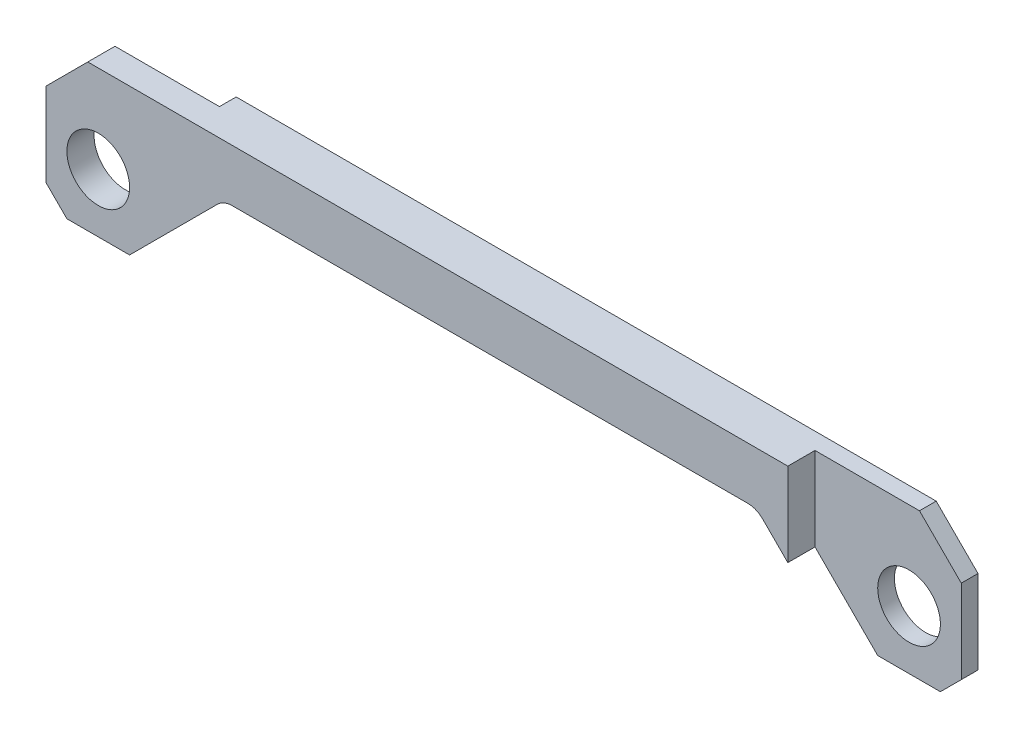
ISO-10303-21;
HEADER;
FILE_DESCRIPTION(('STEP AP214'),'2;1');
FILE_NAME('part.step','',(''),(''),'','','');
FILE_SCHEMA(('AUTOMOTIVE_DESIGN { 1 0 10303 214 1 1 1 1 }'));
ENDSEC;
DATA;
#1=APPLICATION_CONTEXT('core data for automotive mechanical design processes');
#2=APPLICATION_PROTOCOL_DEFINITION('international standard','automotive_design',2000,#1);
#3=PRODUCT_CONTEXT('',#1,'mechanical');
#4=PRODUCT('Part','Part','',(#3));
#5=PRODUCT_RELATED_PRODUCT_CATEGORY('part','',(#4));
#6=PRODUCT_DEFINITION_FORMATION('','',#4);
#7=PRODUCT_DEFINITION_CONTEXT('part definition',#1,'design');
#8=PRODUCT_DEFINITION('design','',#6,#7);
#9=PRODUCT_DEFINITION_SHAPE('','',#8);
#10=(LENGTH_UNIT() NAMED_UNIT(*) SI_UNIT(.MILLI.,.METRE.));
#11=(NAMED_UNIT(*) PLANE_ANGLE_UNIT() SI_UNIT($,.RADIAN.));
#12=(NAMED_UNIT(*) SI_UNIT($,.STERADIAN.) SOLID_ANGLE_UNIT());
#13=UNCERTAINTY_MEASURE_WITH_UNIT(LENGTH_MEASURE(1.E-05),#10,'distance_accuracy_value','');
#14=(GEOMETRIC_REPRESENTATION_CONTEXT(3) GLOBAL_UNCERTAINTY_ASSIGNED_CONTEXT((#13)) GLOBAL_UNIT_ASSIGNED_CONTEXT((#10,
#11,#12)) REPRESENTATION_CONTEXT('',''));
#15=CARTESIAN_POINT('',(0.,0.,0.));
#16=DIRECTION('',(0.,0.,1.));
#17=DIRECTION('',(1.,0.,0.));
#18=AXIS2_PLACEMENT_3D('',#15,#16,#17);
#19=CARTESIAN_POINT('',(0.,0.,53.34));
#20=DIRECTION('',(0.,0.,-1.));
#21=DIRECTION('',(-1.,0.,0.));
#22=AXIS2_PLACEMENT_3D('',#19,#20,#21);
#23=PLANE('',#22);
#24=DIRECTION('',(1.,0.,0.));
#25=VECTOR('',#24,1.);
#26=CARTESIAN_POINT('',(800.100000000001,43.1800000000001,53.34));
#27=LINE('',#26,#25);
#28=CARTESIAN_POINT('',(162.921024484276,43.18,53.34));
#29=VERTEX_POINT('',#28);
#30=CARTESIAN_POINT('',(789.578975515724,43.1800000000001,53.34));
#31=VERTEX_POINT('',#30);
#32=EDGE_CURVE('E272',#29,#31,#27,.T.);
#33=ORIENTED_EDGE('',*,*,#32,.T.);
#34=CARTESIAN_POINT('',(789.578975515724,17.7800000000001,53.34));
#35=DIRECTION('',(0.,0.,-1.));
#36=DIRECTION('',(-1.,0.,0.));
#37=AXIS2_PLACEMENT_3D('',#34,#35,#36);
#38=CIRCLE('',#37,25.4);
#39=CARTESIAN_POINT('',(807.539487757862,35.7405122421383,53.34));
#40=VERTEX_POINT('',#39);
#41=EDGE_CURVE('E11',#31,#40,#38,.T.);
#42=ORIENTED_EDGE('',*,*,#41,.T.);
#43=DIRECTION('',(0.707106781186546,-0.707106781186549,0.));
#44=VECTOR('',#43,1.);
#45=CARTESIAN_POINT('',(914.4,-71.1199999999999,53.34));
#46=LINE('',#45,#44);
#47=CARTESIAN_POINT('',(838.2,5.08000000000058,53.34));
#48=VERTEX_POINT('',#47);
#49=EDGE_CURVE('E275',#40,#48,#46,.T.);
#50=ORIENTED_EDGE('',*,*,#49,.T.);
#51=DIRECTION('',(0.,1.,0.));
#52=VECTOR('',#51,1.);
#53=CARTESIAN_POINT('',(838.2,-71.12,53.34));
#54=LINE('',#53,#52);
#55=CARTESIAN_POINT('',(838.2,106.68,53.34));
#56=VERTEX_POINT('',#55);
#57=EDGE_CURVE('E218',#48,#56,#54,.T.);
#58=ORIENTED_EDGE('',*,*,#57,.T.);
#59=DIRECTION('',(-1.,0.,0.));
#60=VECTOR('',#59,1.);
#61=CARTESIAN_POINT('',(-12.7000000000002,106.68,53.34));
#62=LINE('',#61,#60);
#63=CARTESIAN_POINT('',(-12.7000000000002,106.68,53.34));
#64=VERTEX_POINT('',#63);
#65=EDGE_CURVE('E278',#56,#64,#62,.T.);
#66=ORIENTED_EDGE('',*,*,#65,.T.);
#67=DIRECTION('',(-0.707106781186546,-0.707106781186549,0.));
#68=VECTOR('',#67,1.);
#69=CARTESIAN_POINT('',(-63.4999999999999,55.88,53.34));
#70=LINE('',#69,#68);
#71=CARTESIAN_POINT('',(-63.4999999999999,55.88,53.34));
#72=VERTEX_POINT('',#71);
#73=EDGE_CURVE('E281',#64,#72,#70,.T.);
#74=ORIENTED_EDGE('',*,*,#73,.T.);
#75=DIRECTION('',(0.,-1.,0.));
#76=VECTOR('',#75,1.);
#77=CARTESIAN_POINT('',(-63.4999999999999,-45.7200000000001,53.34));
#78=LINE('',#77,#76);
#79=CARTESIAN_POINT('',(-63.4999999999999,-45.7200000000001,53.34));
#80=VERTEX_POINT('',#79);
#81=EDGE_CURVE('E284',#72,#80,#78,.T.);
#82=ORIENTED_EDGE('',*,*,#81,.T.);
#83=DIRECTION('',(0.707106781186549,-0.707106781186546,0.));
#84=VECTOR('',#83,1.);
#85=CARTESIAN_POINT('',(-38.1,-71.12,53.34));
#86=LINE('',#85,#84);
#87=CARTESIAN_POINT('',(-38.1,-71.12,53.34));
#88=VERTEX_POINT('',#87);
#89=EDGE_CURVE('E287',#80,#88,#86,.T.);
#90=ORIENTED_EDGE('',*,*,#89,.T.);
#91=DIRECTION('',(1.,0.,0.));
#92=VECTOR('',#91,1.);
#93=CARTESIAN_POINT('',(38.1,-71.12,53.34));
#94=LINE('',#93,#92);
#95=CARTESIAN_POINT('',(38.1,-71.12,53.34));
#96=VERTEX_POINT('',#95);
#97=EDGE_CURVE('E290',#88,#96,#94,.T.);
#98=ORIENTED_EDGE('',*,*,#97,.T.);
#99=DIRECTION('',(0.707106781186546,0.707106781186549,0.));
#100=VECTOR('',#99,1.);
#101=CARTESIAN_POINT('',(152.399999999999,43.18,53.34));
#102=LINE('',#101,#100);
#103=CARTESIAN_POINT('',(144.960512242138,35.7405122421383,53.34));
#104=VERTEX_POINT('',#103);
#105=EDGE_CURVE('E268',#96,#104,#102,.T.);
#106=ORIENTED_EDGE('',*,*,#105,.T.);
#107=CARTESIAN_POINT('',(162.921024484276,17.78,53.34));
#108=DIRECTION('',(0.,0.,-1.));
#109=DIRECTION('',(-1.,0.,0.));
#110=AXIS2_PLACEMENT_3D('',#107,#108,#109);
#111=CIRCLE('',#110,25.4);
#112=EDGE_CURVE('E378',#104,#29,#111,.T.);
#113=ORIENTED_EDGE('',*,*,#112,.T.);
#114=EDGE_LOOP('',(#33,#42,#50,#58,#66,#74,#82,#90,#98,#106,#113));
#115=FACE_BOUND('',#114,.T.);
#116=CARTESIAN_POINT('',(0.,0.,53.34));
#117=DIRECTION('',(0.,0.,1.));
#118=DIRECTION('',(1.,0.,0.));
#119=AXIS2_PLACEMENT_3D('',#116,#117,#118);
#120=CIRCLE('',#119,38.1);
#121=CARTESIAN_POINT('',(38.1,0.,53.34));
#122=VERTEX_POINT('',#121);
#123=EDGE_CURVE('E263',#122,#122,#120,.T.);
#124=ORIENTED_EDGE('',*,*,#123,.F.);
#125=EDGE_LOOP('',(#124));
#126=FACE_BOUND('',#125,.T.);
#127=ADVANCED_FACE('F45',(#115,#126),#23,.F.);
#128=CARTESIAN_POINT('',(0.,0.,0.));
#129=DIRECTION('',(0.,0.,-1.));
#130=DIRECTION('',(-1.,0.,0.));
#131=AXIS2_PLACEMENT_3D('',#128,#129,#130);
#132=PLANE('',#131);
#133=DIRECTION('',(0.,1.,0.));
#134=VECTOR('',#133,1.);
#135=CARTESIAN_POINT('',(114.3,-71.12,0.));
#136=LINE('',#135,#134);
#137=CARTESIAN_POINT('',(114.3,5.08000000000033,0.));
#138=VERTEX_POINT('',#137);
#139=CARTESIAN_POINT('',(114.3,106.68,0.));
#140=VERTEX_POINT('',#139);
#141=EDGE_CURVE('E180',#138,#140,#136,.T.);
#142=ORIENTED_EDGE('',*,*,#141,.T.);
#143=DIRECTION('',(-1.,0.,0.));
#144=VECTOR('',#143,1.);
#145=CARTESIAN_POINT('',(-12.7000000000002,106.68,0.));
#146=LINE('',#145,#144);
#147=CARTESIAN_POINT('',(965.2,106.68,0.));
#148=VERTEX_POINT('',#147);
#149=EDGE_CURVE('E197',#148,#140,#146,.T.);
#150=ORIENTED_EDGE('',*,*,#149,.F.);
#151=DIRECTION('',(-0.707106781186548,0.707106781186547,0.));
#152=VECTOR('',#151,1.);
#153=CARTESIAN_POINT('',(965.2,106.68,0.));
#154=LINE('',#153,#152);
#155=CARTESIAN_POINT('',(1016.,55.8800000000002,0.));
#156=VERTEX_POINT('',#155);
#157=EDGE_CURVE('E316',#156,#148,#154,.T.);
#158=ORIENTED_EDGE('',*,*,#157,.F.);
#159=DIRECTION('',(0.,1.,0.));
#160=VECTOR('',#159,1.);
#161=CARTESIAN_POINT('',(1016.,55.8800000000002,0.));
#162=LINE('',#161,#160);
#163=CARTESIAN_POINT('',(1016.,-45.7199999999999,0.));
#164=VERTEX_POINT('',#163);
#165=EDGE_CURVE('E312',#164,#156,#162,.T.);
#166=ORIENTED_EDGE('',*,*,#165,.F.);
#167=DIRECTION('',(0.707106781186545,0.707106781186549,0.));
#168=VECTOR('',#167,1.);
#169=CARTESIAN_POINT('',(1016.,-45.7199999999999,0.));
#170=LINE('',#169,#168);
#171=CARTESIAN_POINT('',(990.6,-71.1199999999999,0.));
#172=VERTEX_POINT('',#171);
#173=EDGE_CURVE('E308',#172,#164,#170,.T.);
#174=ORIENTED_EDGE('',*,*,#173,.F.);
#175=DIRECTION('',(1.,0.,0.));
#176=VECTOR('',#175,1.);
#177=CARTESIAN_POINT('',(990.6,-71.1199999999999,0.));
#178=LINE('',#177,#176);
#179=CARTESIAN_POINT('',(914.4,-71.1199999999999,0.));
#180=VERTEX_POINT('',#179);
#181=EDGE_CURVE('E304',#180,#172,#178,.T.);
#182=ORIENTED_EDGE('',*,*,#181,.F.);
#183=DIRECTION('',(0.707106781186546,-0.707106781186549,0.));
#184=VECTOR('',#183,1.);
#185=CARTESIAN_POINT('',(914.4,-71.1199999999999,0.));
#186=LINE('',#185,#184);
#187=CARTESIAN_POINT('',(807.539487757862,35.7405122421383,0.));
#188=VERTEX_POINT('',#187);
#189=EDGE_CURVE('E301',#188,#180,#186,.T.);
#190=ORIENTED_EDGE('',*,*,#189,.F.);
#191=CARTESIAN_POINT('',(789.578975515724,17.7800000000001,0.));
#192=DIRECTION('',(0.,0.,-1.));
#193=DIRECTION('',(-1.,0.,0.));
#194=AXIS2_PLACEMENT_3D('',#191,#192,#193);
#195=CIRCLE('',#194,25.4);
#196=CARTESIAN_POINT('',(789.578975515724,43.1800000000001,0.));
#197=VERTEX_POINT('',#196);
#198=EDGE_CURVE('E54',#188,#197,#195,.F.);
#199=ORIENTED_EDGE('',*,*,#198,.T.);
#200=DIRECTION('',(1.,0.,0.));
#201=VECTOR('',#200,1.);
#202=CARTESIAN_POINT('',(800.100000000001,43.1800000000001,0.));
#203=LINE('',#202,#201);
#204=CARTESIAN_POINT('',(162.921024484276,43.18,0.));
#205=VERTEX_POINT('',#204);
#206=EDGE_CURVE('E297',#205,#197,#203,.T.);
#207=ORIENTED_EDGE('',*,*,#206,.F.);
#208=CARTESIAN_POINT('',(162.921024484276,17.78,0.));
#209=DIRECTION('',(0.,0.,-1.));
#210=DIRECTION('',(-1.,0.,0.));
#211=AXIS2_PLACEMENT_3D('',#208,#209,#210);
#212=CIRCLE('',#211,25.4);
#213=CARTESIAN_POINT('',(144.960512242138,35.7405122421383,0.));
#214=VERTEX_POINT('',#213);
#215=EDGE_CURVE('E375',#205,#214,#212,.F.);
#216=ORIENTED_EDGE('',*,*,#215,.T.);
#217=DIRECTION('',(0.707106781186546,0.707106781186549,0.));
#218=VECTOR('',#217,1.);
#219=CARTESIAN_POINT('',(152.399999999999,43.18,0.));
#220=LINE('',#219,#218);
#221=EDGE_CURVE('E267',#138,#214,#220,.T.);
#222=ORIENTED_EDGE('',*,*,#221,.F.);
#223=EDGE_LOOP('',(#142,#150,#158,#166,#174,#182,#190,#199,#207,#216,#222));
#224=FACE_BOUND('',#223,.T.);
#225=CARTESIAN_POINT('',(952.5,0.,0.));
#226=DIRECTION('',(0.,0.,1.));
#227=DIRECTION('',(1.,0.,0.));
#228=AXIS2_PLACEMENT_3D('',#225,#226,#227);
#229=CIRCLE('',#228,38.1);
#230=CARTESIAN_POINT('',(990.6,0.,0.));
#231=VERTEX_POINT('',#230);
#232=EDGE_CURVE('E259',#231,#231,#229,.T.);
#233=ORIENTED_EDGE('',*,*,#232,.T.);
#234=EDGE_LOOP('',(#233));
#235=FACE_BOUND('',#234,.T.);
#236=ADVANCED_FACE('F385',(#224,#235),#132,.T.);
#237=CARTESIAN_POINT('',(152.399999999999,43.18,53.34));
#238=DIRECTION('',(-0.707106781186549,0.707106781186546,0.));
#239=DIRECTION('',(-0.707106781186546,-0.707106781186549,0.));
#240=AXIS2_PLACEMENT_3D('',#237,#238,#239);
#241=PLANE('',#240);
#242=ORIENTED_EDGE('',*,*,#221,.T.);
#243=DIRECTION('',(0.,0.,-1.));
#244=VECTOR('',#243,1.);
#245=CARTESIAN_POINT('',(144.960512242138,35.7405122421383,53.34));
#246=LINE('',#245,#244);
#247=EDGE_CURVE('E369',#214,#104,#246,.F.);
#248=ORIENTED_EDGE('',*,*,#247,.T.);
#249=ORIENTED_EDGE('',*,*,#105,.F.);
#250=DIRECTION('',(0.,0.,-1.));
#251=VECTOR('',#250,1.);
#252=CARTESIAN_POINT('',(38.1,-71.12,53.34));
#253=LINE('',#252,#251);
#254=CARTESIAN_POINT('',(38.1,-71.12,20.32));
#255=VERTEX_POINT('',#254);
#256=EDGE_CURVE('E293',#96,#255,#253,.T.);
#257=ORIENTED_EDGE('',*,*,#256,.T.);
#258=DIRECTION('',(0.707106781186546,0.707106781186549,0.));
#259=VECTOR('',#258,1.);
#260=CARTESIAN_POINT('',(152.399999999999,43.18,20.32));
#261=LINE('',#260,#259);
#262=CARTESIAN_POINT('',(114.3,5.0800000000003,20.32));
#263=VERTEX_POINT('',#262);
#264=EDGE_CURVE('E250',#255,#263,#261,.T.);
#265=ORIENTED_EDGE('',*,*,#264,.T.);
#266=DIRECTION('',(0.,0.,-1.));
#267=VECTOR('',#266,1.);
#268=CARTESIAN_POINT('',(114.3,5.08000000000033,53.34));
#269=LINE('',#268,#267);
#270=EDGE_CURVE('E176',#263,#138,#269,.T.);
#271=ORIENTED_EDGE('',*,*,#270,.T.);
#272=EDGE_LOOP('',(#242,#248,#249,#257,#265,#271));
#273=FACE_BOUND('',#272,.T.);
#274=ADVANCED_FACE('F424',(#273),#241,.F.);
#275=CARTESIAN_POINT('',(800.100000000001,43.1800000000001,53.34));
#276=DIRECTION('',(0.,1.,0.));
#277=DIRECTION('',(-1.,0.,0.));
#278=AXIS2_PLACEMENT_3D('',#275,#276,#277);
#279=PLANE('',#278);
#280=ORIENTED_EDGE('',*,*,#32,.F.);
#281=DIRECTION('',(0.,0.,-1.));
#282=VECTOR('',#281,1.);
#283=CARTESIAN_POINT('',(162.921024484276,43.18,0.));
#284=LINE('',#283,#282);
#285=EDGE_CURVE('E365',#29,#205,#284,.T.);
#286=ORIENTED_EDGE('',*,*,#285,.T.);
#287=ORIENTED_EDGE('',*,*,#206,.T.);
#288=DIRECTION('',(0.,0.,-1.));
#289=VECTOR('',#288,1.);
#290=CARTESIAN_POINT('',(789.578975515724,43.1800000000001,53.34));
#291=LINE('',#290,#289);
#292=EDGE_CURVE('E356',#197,#31,#291,.F.);
#293=ORIENTED_EDGE('',*,*,#292,.T.);
#294=EDGE_LOOP('',(#280,#286,#287,#293));
#295=FACE_BOUND('',#294,.T.);
#296=ADVANCED_FACE('F390',(#295),#279,.F.);
#297=CARTESIAN_POINT('',(914.4,-71.1199999999999,53.34));
#298=DIRECTION('',(0.707106781186549,0.707106781186546,0.));
#299=DIRECTION('',(-0.707106781186546,0.707106781186549,0.));
#300=AXIS2_PLACEMENT_3D('',#297,#298,#299);
#301=PLANE('',#300);
#302=ORIENTED_EDGE('',*,*,#49,.F.);
#303=DIRECTION('',(0.,0.,-1.));
#304=VECTOR('',#303,1.);
#305=CARTESIAN_POINT('',(807.539487757862,35.7405122421383,0.));
#306=LINE('',#305,#304);
#307=EDGE_CURVE('E372',#40,#188,#306,.T.);
#308=ORIENTED_EDGE('',*,*,#307,.T.);
#309=ORIENTED_EDGE('',*,*,#189,.T.);
#310=DIRECTION('',(0.,0.,-1.));
#311=VECTOR('',#310,1.);
#312=CARTESIAN_POINT('',(914.4,-71.1199999999999,53.34));
#313=LINE('',#312,#311);
#314=CARTESIAN_POINT('',(914.4,-71.12,20.32));
#315=VERTEX_POINT('',#314);
#316=EDGE_CURVE('E352',#315,#180,#313,.T.);
#317=ORIENTED_EDGE('',*,*,#316,.F.);
#318=DIRECTION('',(-0.707106781186546,0.707106781186549,0.));
#319=VECTOR('',#318,1.);
#320=CARTESIAN_POINT('',(914.4,-71.1199999999999,20.32));
#321=LINE('',#320,#319);
#322=CARTESIAN_POINT('',(838.2,5.0800000000006,20.32));
#323=VERTEX_POINT('',#322);
#324=EDGE_CURVE('E239',#315,#323,#321,.T.);
#325=ORIENTED_EDGE('',*,*,#324,.T.);
#326=DIRECTION('',(0.,0.,1.));
#327=VECTOR('',#326,1.);
#328=CARTESIAN_POINT('',(838.2,5.08000000000058,53.34));
#329=LINE('',#328,#327);
#330=EDGE_CURVE('E253',#323,#48,#329,.T.);
#331=ORIENTED_EDGE('',*,*,#330,.T.);
#332=EDGE_LOOP('',(#302,#308,#309,#317,#325,#331));
#333=FACE_BOUND('',#332,.T.);
#334=ADVANCED_FACE('F393',(#333),#301,.F.);
#335=CARTESIAN_POINT('',(990.6,-71.1199999999999,53.34));
#336=DIRECTION('',(0.,1.,0.));
#337=DIRECTION('',(-1.,0.,0.));
#338=AXIS2_PLACEMENT_3D('',#335,#336,#337);
#339=PLANE('',#338);
#340=DIRECTION('',(0.,0.,-1.));
#341=VECTOR('',#340,1.);
#342=CARTESIAN_POINT('',(990.6,-71.1199999999999,53.34));
#343=LINE('',#342,#341);
#344=CARTESIAN_POINT('',(990.6,-71.12,20.32));
#345=VERTEX_POINT('',#344);
#346=EDGE_CURVE('E349',#345,#172,#343,.T.);
#347=ORIENTED_EDGE('',*,*,#346,.F.);
#348=DIRECTION('',(-1.,0.,0.));
#349=VECTOR('',#348,1.);
#350=CARTESIAN_POINT('',(1016.,-71.12,20.32));
#351=LINE('',#350,#349);
#352=EDGE_CURVE('E214',#345,#315,#351,.T.);
#353=ORIENTED_EDGE('',*,*,#352,.T.);
#354=ORIENTED_EDGE('',*,*,#316,.T.);
#355=ORIENTED_EDGE('',*,*,#181,.T.);
#356=EDGE_LOOP('',(#347,#353,#354,#355));
#357=FACE_BOUND('',#356,.T.);
#358=ADVANCED_FACE('F443',(#357),#339,.F.);
#359=CARTESIAN_POINT('',(1016.,-45.7199999999999,53.34));
#360=DIRECTION('',(-0.70710678118655,0.707106781186546,0.));
#361=DIRECTION('',(-0.707106781186546,-0.70710678118655,0.));
#362=AXIS2_PLACEMENT_3D('',#359,#360,#361);
#363=PLANE('',#362);
#364=DIRECTION('',(0.,0.,-1.));
#365=VECTOR('',#364,1.);
#366=CARTESIAN_POINT('',(1016.,-45.7199999999999,53.34));
#367=LINE('',#366,#365);
#368=CARTESIAN_POINT('',(1016.,-45.7199999999999,20.32));
#369=VERTEX_POINT('',#368);
#370=EDGE_CURVE('E346',#369,#164,#367,.T.);
#371=ORIENTED_EDGE('',*,*,#370,.F.);
#372=DIRECTION('',(-0.707106781186546,-0.70710678118655,0.));
#373=VECTOR('',#372,1.);
#374=CARTESIAN_POINT('',(1016.,-45.7199999999999,20.32));
#375=LINE('',#374,#373);
#376=EDGE_CURVE('E235',#369,#345,#375,.T.);
#377=ORIENTED_EDGE('',*,*,#376,.T.);
#378=ORIENTED_EDGE('',*,*,#346,.T.);
#379=ORIENTED_EDGE('',*,*,#173,.T.);
#380=EDGE_LOOP('',(#371,#377,#378,#379));
#381=FACE_BOUND('',#380,.T.);
#382=ADVANCED_FACE('F440',(#381),#363,.F.);
#383=CARTESIAN_POINT('',(1016.,55.8800000000002,53.34));
#384=DIRECTION('',(-1.,0.,0.));
#385=DIRECTION('',(0.,0.,1.));
#386=AXIS2_PLACEMENT_3D('',#383,#384,#385);
#387=PLANE('',#386);
#388=DIRECTION('',(0.,0.,-1.));
#389=VECTOR('',#388,1.);
#390=CARTESIAN_POINT('',(1016.,55.8800000000002,53.34));
#391=LINE('',#390,#389);
#392=CARTESIAN_POINT('',(1016.,55.8800000000002,20.32));
#393=VERTEX_POINT('',#392);
#394=EDGE_CURVE('E343',#393,#156,#391,.T.);
#395=ORIENTED_EDGE('',*,*,#394,.F.);
#396=DIRECTION('',(0.,1.,0.));
#397=VECTOR('',#396,1.);
#398=CARTESIAN_POINT('',(1016.,-71.12,20.32));
#399=LINE('',#398,#397);
#400=EDGE_CURVE('E211',#369,#393,#399,.T.);
#401=ORIENTED_EDGE('',*,*,#400,.F.);
#402=ORIENTED_EDGE('',*,*,#370,.T.);
#403=ORIENTED_EDGE('',*,*,#165,.T.);
#404=EDGE_LOOP('',(#395,#401,#402,#403));
#405=FACE_BOUND('',#404,.T.);
#406=ADVANCED_FACE('F437',(#405),#387,.F.);
#407=CARTESIAN_POINT('',(965.2,106.68,53.34));
#408=DIRECTION('',(-0.707106781186547,-0.707106781186548,0.));
#409=DIRECTION('',(0.707106781186548,-0.707106781186547,0.));
#410=AXIS2_PLACEMENT_3D('',#407,#408,#409);
#411=PLANE('',#410);
#412=DIRECTION('',(0.,0.,-1.));
#413=VECTOR('',#412,1.);
#414=CARTESIAN_POINT('',(965.2,106.68,53.34));
#415=LINE('',#414,#413);
#416=CARTESIAN_POINT('',(965.2,106.68,20.32));
#417=VERTEX_POINT('',#416);
#418=EDGE_CURVE('E340',#417,#148,#415,.T.);
#419=ORIENTED_EDGE('',*,*,#418,.F.);
#420=DIRECTION('',(0.707106781186548,-0.707106781186547,0.));
#421=VECTOR('',#420,1.);
#422=CARTESIAN_POINT('',(965.2,106.68,20.32));
#423=LINE('',#422,#421);
#424=EDGE_CURVE('E231',#417,#393,#423,.T.);
#425=ORIENTED_EDGE('',*,*,#424,.T.);
#426=ORIENTED_EDGE('',*,*,#394,.T.);
#427=ORIENTED_EDGE('',*,*,#157,.T.);
#428=EDGE_LOOP('',(#419,#425,#426,#427));
#429=FACE_BOUND('',#428,.T.);
#430=ADVANCED_FACE('F433',(#429),#411,.F.);
#431=CARTESIAN_POINT('',(-12.7000000000002,106.68,53.34));
#432=DIRECTION('',(0.,-1.,0.));
#433=DIRECTION('',(0.,0.,-1.));
#434=AXIS2_PLACEMENT_3D('',#431,#432,#433);
#435=PLANE('',#434);
#436=ORIENTED_EDGE('',*,*,#149,.T.);
#437=DIRECTION('',(0.,0.,-1.));
#438=VECTOR('',#437,1.);
#439=CARTESIAN_POINT('',(114.3,106.68,0.));
#440=LINE('',#439,#438);
#441=CARTESIAN_POINT('',(114.3,106.68,20.32));
#442=VERTEX_POINT('',#441);
#443=EDGE_CURVE('E173',#442,#140,#440,.T.);
#444=ORIENTED_EDGE('',*,*,#443,.F.);
#445=DIRECTION('',(1.,0.,0.));
#446=VECTOR('',#445,1.);
#447=CARTESIAN_POINT('',(-63.4999999999999,106.68,20.32));
#448=LINE('',#447,#446);
#449=CARTESIAN_POINT('',(-12.7000000000002,106.68,20.32));
#450=VERTEX_POINT('',#449);
#451=EDGE_CURVE('E184',#450,#442,#448,.T.);
#452=ORIENTED_EDGE('',*,*,#451,.F.);
#453=DIRECTION('',(0.,0.,-1.));
#454=VECTOR('',#453,1.);
#455=CARTESIAN_POINT('',(-12.7000000000002,106.68,53.34));
#456=LINE('',#455,#454);
#457=EDGE_CURVE('E337',#64,#450,#456,.T.);
#458=ORIENTED_EDGE('',*,*,#457,.F.);
#459=ORIENTED_EDGE('',*,*,#65,.F.);
#460=DIRECTION('',(0.,0.,1.));
#461=VECTOR('',#460,1.);
#462=CARTESIAN_POINT('',(838.2,106.68,53.34));
#463=LINE('',#462,#461);
#464=CARTESIAN_POINT('',(838.2,106.68,20.32));
#465=VERTEX_POINT('',#464);
#466=EDGE_CURVE('E222',#465,#56,#463,.T.);
#467=ORIENTED_EDGE('',*,*,#466,.F.);
#468=DIRECTION('',(-1.,0.,0.));
#469=VECTOR('',#468,1.);
#470=CARTESIAN_POINT('',(1016.,106.68,20.32));
#471=LINE('',#470,#469);
#472=EDGE_CURVE('E192',#417,#465,#471,.T.);
#473=ORIENTED_EDGE('',*,*,#472,.F.);
#474=ORIENTED_EDGE('',*,*,#418,.T.);
#475=EDGE_LOOP('',(#436,#444,#452,#458,#459,#467,#473,#474));
#476=FACE_BOUND('',#475,.T.);
#477=ADVANCED_FACE('F195',(#476),#435,.F.);
#478=CARTESIAN_POINT('',(-63.4999999999999,55.88,53.34));
#479=DIRECTION('',(0.707106781186549,-0.707106781186546,0.));
#480=DIRECTION('',(0.707106781186546,0.707106781186549,0.));
#481=AXIS2_PLACEMENT_3D('',#478,#479,#480);
#482=PLANE('',#481);
#483=ORIENTED_EDGE('',*,*,#457,.T.);
#484=DIRECTION('',(-0.707106781186546,-0.707106781186549,0.));
#485=VECTOR('',#484,1.);
#486=CARTESIAN_POINT('',(-63.4999999999999,55.88,20.32));
#487=LINE('',#486,#485);
#488=CARTESIAN_POINT('',(-63.4999999999999,55.88,20.32));
#489=VERTEX_POINT('',#488);
#490=EDGE_CURVE('E187',#450,#489,#487,.T.);
#491=ORIENTED_EDGE('',*,*,#490,.T.);
#492=DIRECTION('',(0.,0.,-1.));
#493=VECTOR('',#492,1.);
#494=CARTESIAN_POINT('',(-63.4999999999999,55.88,53.34));
#495=LINE('',#494,#493);
#496=EDGE_CURVE('E333',#72,#489,#495,.T.);
#497=ORIENTED_EDGE('',*,*,#496,.F.);
#498=ORIENTED_EDGE('',*,*,#73,.F.);
#499=EDGE_LOOP('',(#483,#491,#497,#498));
#500=FACE_BOUND('',#499,.T.);
#501=ADVANCED_FACE('F409',(#500),#482,.F.);
#502=CARTESIAN_POINT('',(-63.4999999999999,-45.7200000000001,53.34));
#503=DIRECTION('',(1.,0.,0.));
#504=DIRECTION('',(0.,0.,-1.));
#505=AXIS2_PLACEMENT_3D('',#502,#503,#504);
#506=PLANE('',#505);
#507=ORIENTED_EDGE('',*,*,#496,.T.);
#508=DIRECTION('',(0.,1.,0.));
#509=VECTOR('',#508,1.);
#510=CARTESIAN_POINT('',(-63.4999999999999,-71.12,20.32));
#511=LINE('',#510,#509);
#512=CARTESIAN_POINT('',(-63.4999999999999,-45.7200000000001,20.32));
#513=VERTEX_POINT('',#512);
#514=EDGE_CURVE('E181',#513,#489,#511,.T.);
#515=ORIENTED_EDGE('',*,*,#514,.F.);
#516=DIRECTION('',(0.,0.,-1.));
#517=VECTOR('',#516,1.);
#518=CARTESIAN_POINT('',(-63.4999999999999,-45.7200000000001,53.34));
#519=LINE('',#518,#517);
#520=EDGE_CURVE('E329',#80,#513,#519,.T.);
#521=ORIENTED_EDGE('',*,*,#520,.F.);
#522=ORIENTED_EDGE('',*,*,#81,.F.);
#523=EDGE_LOOP('',(#507,#515,#521,#522));
#524=FACE_BOUND('',#523,.T.);
#525=ADVANCED_FACE('F412',(#524),#506,.F.);
#526=CARTESIAN_POINT('',(-38.1,-71.12,53.34));
#527=DIRECTION('',(0.707106781186546,0.707106781186549,0.));
#528=DIRECTION('',(-0.707106781186549,0.707106781186546,0.));
#529=AXIS2_PLACEMENT_3D('',#526,#527,#528);
#530=PLANE('',#529);
#531=ORIENTED_EDGE('',*,*,#520,.T.);
#532=DIRECTION('',(0.707106781186549,-0.707106781186546,0.));
#533=VECTOR('',#532,1.);
#534=CARTESIAN_POINT('',(-38.1,-71.12,20.32));
#535=LINE('',#534,#533);
#536=CARTESIAN_POINT('',(-38.1,-71.12,20.32));
#537=VERTEX_POINT('',#536);
#538=EDGE_CURVE('E244',#513,#537,#535,.T.);
#539=ORIENTED_EDGE('',*,*,#538,.T.);
#540=DIRECTION('',(0.,0.,-1.));
#541=VECTOR('',#540,1.);
#542=CARTESIAN_POINT('',(-38.1,-71.12,53.34));
#543=LINE('',#542,#541);
#544=EDGE_CURVE('E325',#88,#537,#543,.T.);
#545=ORIENTED_EDGE('',*,*,#544,.F.);
#546=ORIENTED_EDGE('',*,*,#89,.F.);
#547=EDGE_LOOP('',(#531,#539,#545,#546));
#548=FACE_BOUND('',#547,.T.);
#549=ADVANCED_FACE('F416',(#548),#530,.F.);
#550=CARTESIAN_POINT('',(38.1,-71.12,53.34));
#551=DIRECTION('',(0.,1.,0.));
#552=DIRECTION('',(0.,0.,1.));
#553=AXIS2_PLACEMENT_3D('',#550,#551,#552);
#554=PLANE('',#553);
#555=ORIENTED_EDGE('',*,*,#544,.T.);
#556=DIRECTION('',(1.,0.,0.));
#557=VECTOR('',#556,1.);
#558=CARTESIAN_POINT('',(-63.4999999999999,-71.12,20.32));
#559=LINE('',#558,#557);
#560=EDGE_CURVE('E199',#537,#255,#559,.T.);
#561=ORIENTED_EDGE('',*,*,#560,.T.);
#562=ORIENTED_EDGE('',*,*,#256,.F.);
#563=ORIENTED_EDGE('',*,*,#97,.F.);
#564=EDGE_LOOP('',(#555,#561,#562,#563));
#565=FACE_BOUND('',#564,.T.);
#566=ADVANCED_FACE('F422',(#565),#554,.F.);
#567=CARTESIAN_POINT('',(0.,0.,53.34));
#568=DIRECTION('',(0.,0.,-1.));
#569=DIRECTION('',(-1.,0.,0.));
#570=AXIS2_PLACEMENT_3D('',#567,#568,#569);
#571=CYLINDRICAL_SURFACE('',#570,38.1);
#572=CARTESIAN_POINT('',(0.,0.,20.32));
#573=DIRECTION('',(0.,0.,1.));
#574=DIRECTION('',(1.,0.,0.));
#575=AXIS2_PLACEMENT_3D('',#572,#573,#574);
#576=CIRCLE('',#575,38.1);
#577=CARTESIAN_POINT('',(38.1,0.,20.32));
#578=VERTEX_POINT('',#577);
#579=EDGE_CURVE('E243',#578,#578,#576,.T.);
#580=ORIENTED_EDGE('',*,*,#579,.F.);
#581=EDGE_LOOP('',(#580));
#582=FACE_BOUND('',#581,.T.);
#583=ORIENTED_EDGE('',*,*,#123,.T.);
#584=EDGE_LOOP('',(#583));
#585=FACE_BOUND('',#584,.T.);
#586=ADVANCED_FACE('F464',(#582,#585),#571,.F.);
#587=CARTESIAN_POINT('',(952.5,0.,53.34));
#588=DIRECTION('',(0.,0.,-1.));
#589=DIRECTION('',(-1.,0.,0.));
#590=AXIS2_PLACEMENT_3D('',#587,#588,#589);
#591=CYLINDRICAL_SURFACE('',#590,38.1);
#592=CARTESIAN_POINT('',(952.5,0.,20.32));
#593=DIRECTION('',(0.,0.,-1.));
#594=DIRECTION('',(-1.,0.,0.));
#595=AXIS2_PLACEMENT_3D('',#592,#593,#594);
#596=CIRCLE('',#595,38.1);
#597=CARTESIAN_POINT('',(914.4,0.,20.32));
#598=VERTEX_POINT('',#597);
#599=EDGE_CURVE('E207',#598,#598,#596,.T.);
#600=ORIENTED_EDGE('',*,*,#599,.F.);
#601=EDGE_LOOP('',(#600));
#602=FACE_BOUND('',#601,.T.);
#603=ORIENTED_EDGE('',*,*,#232,.F.);
#604=EDGE_LOOP('',(#603));
#605=FACE_BOUND('',#604,.T.);
#606=ADVANCED_FACE('F454',(#602,#605),#591,.F.);
#607=CARTESIAN_POINT('',(838.2,-71.12,53.34));
#608=DIRECTION('',(-1.,0.,0.));
#609=DIRECTION('',(0.,0.,1.));
#610=AXIS2_PLACEMENT_3D('',#607,#608,#609);
#611=PLANE('',#610);
#612=DIRECTION('',(0.,1.,0.));
#613=VECTOR('',#612,1.);
#614=CARTESIAN_POINT('',(838.2,-71.12,20.32));
#615=LINE('',#614,#613);
#616=EDGE_CURVE('E215',#323,#465,#615,.T.);
#617=ORIENTED_EDGE('',*,*,#616,.T.);
#618=ORIENTED_EDGE('',*,*,#466,.T.);
#619=ORIENTED_EDGE('',*,*,#57,.F.);
#620=ORIENTED_EDGE('',*,*,#330,.F.);
#621=EDGE_LOOP('',(#617,#618,#619,#620));
#622=FACE_BOUND('',#621,.T.);
#623=ADVANCED_FACE('F399',(#622),#611,.F.);
#624=CARTESIAN_POINT('',(1016.,-71.12,20.32));
#625=DIRECTION('',(0.,0.,-1.));
#626=DIRECTION('',(-1.,0.,0.));
#627=AXIS2_PLACEMENT_3D('',#624,#625,#626);
#628=PLANE('',#627);
#629=ORIENTED_EDGE('',*,*,#599,.T.);
#630=EDGE_LOOP('',(#629));
#631=FACE_BOUND('',#630,.T.);
#632=ORIENTED_EDGE('',*,*,#352,.F.);
#633=ORIENTED_EDGE('',*,*,#376,.F.);
#634=ORIENTED_EDGE('',*,*,#400,.T.);
#635=ORIENTED_EDGE('',*,*,#424,.F.);
#636=ORIENTED_EDGE('',*,*,#472,.T.);
#637=ORIENTED_EDGE('',*,*,#616,.F.);
#638=ORIENTED_EDGE('',*,*,#324,.F.);
#639=EDGE_LOOP('',(#632,#633,#634,#635,#636,#637,#638));
#640=FACE_BOUND('',#639,.T.);
#641=ADVANCED_FACE('F445',(#631,#640),#628,.F.);
#642=CARTESIAN_POINT('',(114.3,-71.12,0.));
#643=DIRECTION('',(1.,0.,0.));
#644=DIRECTION('',(0.,0.,-1.));
#645=AXIS2_PLACEMENT_3D('',#642,#643,#644);
#646=PLANE('',#645);
#647=DIRECTION('',(0.,1.,0.));
#648=VECTOR('',#647,1.);
#649=CARTESIAN_POINT('',(114.3,-71.12,20.32));
#650=LINE('',#649,#648);
#651=EDGE_CURVE('E169',#263,#442,#650,.T.);
#652=ORIENTED_EDGE('',*,*,#651,.T.);
#653=ORIENTED_EDGE('',*,*,#443,.T.);
#654=ORIENTED_EDGE('',*,*,#141,.F.);
#655=ORIENTED_EDGE('',*,*,#270,.F.);
#656=EDGE_LOOP('',(#652,#653,#654,#655));
#657=FACE_BOUND('',#656,.T.);
#658=ADVANCED_FACE('F171',(#657),#646,.F.);
#659=CARTESIAN_POINT('',(-63.4999999999999,-71.12,20.32));
#660=DIRECTION('',(0.,0.,1.));
#661=DIRECTION('',(1.,0.,0.));
#662=AXIS2_PLACEMENT_3D('',#659,#660,#661);
#663=PLANE('',#662);
#664=ORIENTED_EDGE('',*,*,#579,.T.);
#665=EDGE_LOOP('',(#664));
#666=FACE_BOUND('',#665,.T.);
#667=ORIENTED_EDGE('',*,*,#560,.F.);
#668=ORIENTED_EDGE('',*,*,#538,.F.);
#669=ORIENTED_EDGE('',*,*,#514,.T.);
#670=ORIENTED_EDGE('',*,*,#490,.F.);
#671=ORIENTED_EDGE('',*,*,#451,.T.);
#672=ORIENTED_EDGE('',*,*,#651,.F.);
#673=ORIENTED_EDGE('',*,*,#264,.F.);
#674=EDGE_LOOP('',(#667,#668,#669,#670,#671,#672,#673));
#675=FACE_BOUND('',#674,.T.);
#676=ADVANCED_FACE('F185',(#666,#675),#663,.F.);
#677=CARTESIAN_POINT('',(162.921024484276,17.78,53.34));
#678=DIRECTION('',(0.,0.,1.));
#679=DIRECTION('',(1.,0.,0.));
#680=AXIS2_PLACEMENT_3D('',#677,#678,#679);
#681=CYLINDRICAL_SURFACE('',#680,25.4);
#682=ORIENTED_EDGE('',*,*,#112,.F.);
#683=ORIENTED_EDGE('',*,*,#247,.F.);
#684=ORIENTED_EDGE('',*,*,#215,.F.);
#685=ORIENTED_EDGE('',*,*,#285,.F.);
#686=EDGE_LOOP('',(#682,#683,#684,#685));
#687=FACE_BOUND('',#686,.T.);
#688=ADVANCED_FACE('F428',(#687),#681,.F.);
#689=CARTESIAN_POINT('',(789.578975515724,17.7800000000001,53.34));
#690=DIRECTION('',(0.,0.,1.));
#691=DIRECTION('',(1.,0.,0.));
#692=AXIS2_PLACEMENT_3D('',#689,#690,#691);
#693=CYLINDRICAL_SURFACE('',#692,25.4);
#694=ORIENTED_EDGE('',*,*,#41,.F.);
#695=ORIENTED_EDGE('',*,*,#292,.F.);
#696=ORIENTED_EDGE('',*,*,#198,.F.);
#697=ORIENTED_EDGE('',*,*,#307,.F.);
#698=EDGE_LOOP('',(#694,#695,#696,#697));
#699=FACE_BOUND('',#698,.T.);
#700=ADVANCED_FACE('F47',(#699),#693,.F.);
#701=CLOSED_SHELL('',(#127,#236,#274,#296,#334,#358,#382,#406,#430,#477,#501,#525,#549,#566,
#586,#606,#623,#641,#658,#676,#688,#700));
#702=MANIFOLD_SOLID_BREP('B2',#701);
#703=ADVANCED_BREP_SHAPE_REPRESENTATION('',(#18,#702),#14);
#704=SHAPE_DEFINITION_REPRESENTATION(#9,#703);
ENDSEC;
END-ISO-10303-21;
